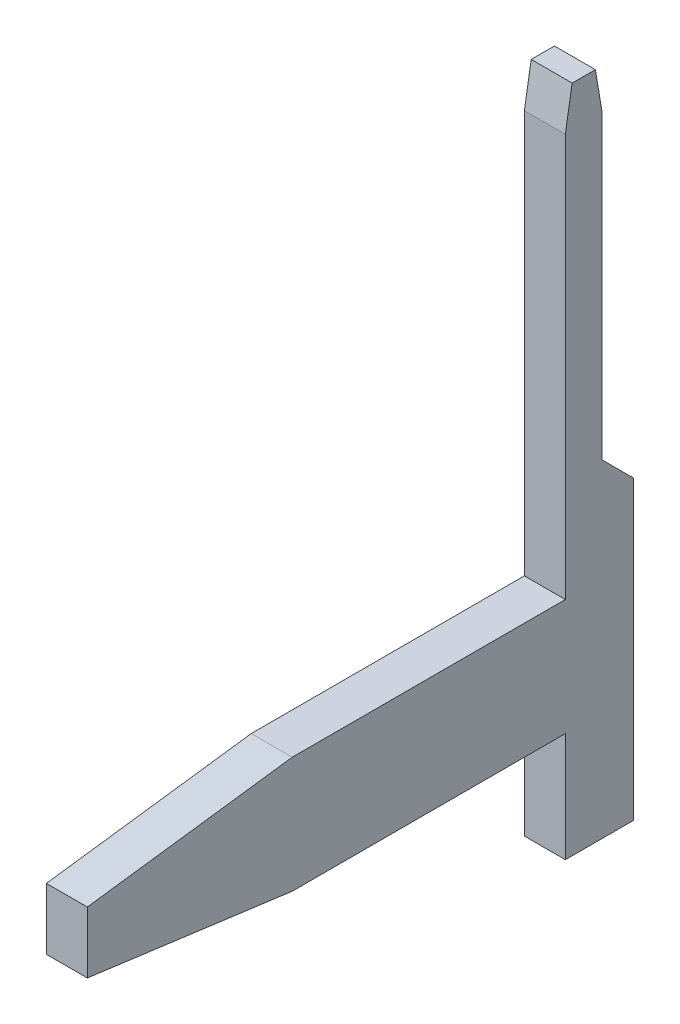
ISO-10303-21;
HEADER;
FILE_DESCRIPTION(('STEP AP214'),'2;1');
FILE_NAME('part.step','',(''),(''),'','','');
FILE_SCHEMA(('AUTOMOTIVE_DESIGN { 1 0 10303 214 1 1 1 1 }'));
ENDSEC;
DATA;
#1=APPLICATION_CONTEXT('core data for automotive mechanical design processes');
#2=APPLICATION_PROTOCOL_DEFINITION('international standard','automotive_design',2000,#1);
#3=PRODUCT_CONTEXT('',#1,'mechanical');
#4=PRODUCT('Part','Part','',(#3));
#5=PRODUCT_RELATED_PRODUCT_CATEGORY('part','',(#4));
#6=PRODUCT_DEFINITION_FORMATION('','',#4);
#7=PRODUCT_DEFINITION_CONTEXT('part definition',#1,'design');
#8=PRODUCT_DEFINITION('design','',#6,#7);
#9=PRODUCT_DEFINITION_SHAPE('','',#8);
#10=(LENGTH_UNIT() NAMED_UNIT(*) SI_UNIT(.MILLI.,.METRE.));
#11=(NAMED_UNIT(*) PLANE_ANGLE_UNIT() SI_UNIT($,.RADIAN.));
#12=(NAMED_UNIT(*) SI_UNIT($,.STERADIAN.) SOLID_ANGLE_UNIT());
#13=UNCERTAINTY_MEASURE_WITH_UNIT(LENGTH_MEASURE(1.E-05),#10,'distance_accuracy_value','');
#14=(GEOMETRIC_REPRESENTATION_CONTEXT(3) GLOBAL_UNCERTAINTY_ASSIGNED_CONTEXT((#13)) GLOBAL_UNIT_ASSIGNED_CONTEXT((#10,
#11,#12)) REPRESENTATION_CONTEXT('',''));
#15=CARTESIAN_POINT('',(0.,0.,0.));
#16=DIRECTION('',(0.,0.,1.));
#17=DIRECTION('',(1.,0.,0.));
#18=AXIS2_PLACEMENT_3D('',#15,#16,#17);
#19=CARTESIAN_POINT('',(-0.15,0.,0.));
#20=DIRECTION('',(1.,0.,0.));
#21=DIRECTION('',(0.,0.,-1.));
#22=AXIS2_PLACEMENT_3D('',#19,#20,#21);
#23=PLANE('',#22);
#24=DIRECTION('',(0.,0.986393923832198,-0.164398987305033));
#25=VECTOR('',#24,1.);
#26=CARTESIAN_POINT('',(-0.15,3.375,0.25));
#27=LINE('',#26,#25);
#28=CARTESIAN_POINT('',(-0.15,3.375,0.25));
#29=VERTEX_POINT('',#28);
#30=CARTESIAN_POINT('',(-0.15,3.675,0.200000000000025));
#31=VERTEX_POINT('',#30);
#32=EDGE_CURVE('E119',#29,#31,#27,.T.);
#33=ORIENTED_EDGE('',*,*,#32,.T.);
#34=DIRECTION('',(0.,0.,-1.));
#35=VECTOR('',#34,1.);
#36=CARTESIAN_POINT('',(-0.15,3.675,-0.02));
#37=LINE('',#36,#35);
#38=CARTESIAN_POINT('',(-0.15,3.675,0.03));
#39=VERTEX_POINT('',#38);
#40=EDGE_CURVE('E121',#31,#39,#37,.T.);
#41=ORIENTED_EDGE('',*,*,#40,.T.);
#42=DIRECTION('',(0.,0.986393923832144,0.164398987305357));
#43=VECTOR('',#42,1.);
#44=CARTESIAN_POINT('',(-0.15,3.375,-0.02));
#45=LINE('',#44,#43);
#46=CARTESIAN_POINT('',(-0.15,3.37499999999998,-0.0199999999999767));
#47=VERTEX_POINT('',#46);
#48=EDGE_CURVE('E20',#47,#39,#45,.T.);
#49=ORIENTED_EDGE('',*,*,#48,.F.);
#50=DIRECTION('',(0.,1.,0.));
#51=VECTOR('',#50,1.);
#52=CARTESIAN_POINT('',(-0.15,1.175,-0.02));
#53=LINE('',#52,#51);
#54=CARTESIAN_POINT('',(-0.15,1.175,-0.02));
#55=VERTEX_POINT('',#54);
#56=EDGE_CURVE('E185',#47,#55,#53,.F.);
#57=ORIENTED_EDGE('',*,*,#56,.T.);
#58=DIRECTION('',(0.,-0.707106781186548,-0.707106781186548));
#59=VECTOR('',#58,1.);
#60=CARTESIAN_POINT('',(-0.15,0.945,-0.25));
#61=LINE('',#60,#59);
#62=CARTESIAN_POINT('',(-0.15,0.945,-0.25));
#63=VERTEX_POINT('',#62);
#64=EDGE_CURVE('E180',#55,#63,#61,.T.);
#65=ORIENTED_EDGE('',*,*,#64,.T.);
#66=DIRECTION('',(0.,1.,0.));
#67=VECTOR('',#66,1.);
#68=CARTESIAN_POINT('',(-0.15,-1.225,-0.25));
#69=LINE('',#68,#67);
#70=CARTESIAN_POINT('',(-0.15,-1.225,-0.25));
#71=VERTEX_POINT('',#70);
#72=EDGE_CURVE('E175',#63,#71,#69,.F.);
#73=ORIENTED_EDGE('',*,*,#72,.T.);
#74=DIRECTION('',(0.,0.,1.));
#75=VECTOR('',#74,1.);
#76=CARTESIAN_POINT('',(-0.15,-1.225,0.25));
#77=LINE('',#76,#75);
#78=CARTESIAN_POINT('',(-0.15,-1.225,0.25));
#79=VERTEX_POINT('',#78);
#80=EDGE_CURVE('E170',#71,#79,#77,.T.);
#81=ORIENTED_EDGE('',*,*,#80,.T.);
#82=DIRECTION('',(0.,1.,0.));
#83=VECTOR('',#82,1.);
#84=CARTESIAN_POINT('',(-0.15,-0.425,0.25));
#85=LINE('',#84,#83);
#86=CARTESIAN_POINT('',(-0.15,-0.425,0.25));
#87=VERTEX_POINT('',#86);
#88=EDGE_CURVE('E165',#79,#87,#85,.T.);
#89=ORIENTED_EDGE('',*,*,#88,.T.);
#90=DIRECTION('',(0.,0.,1.));
#91=VECTOR('',#90,1.);
#92=CARTESIAN_POINT('',(-0.15,-0.425,3.75));
#93=LINE('',#92,#91);
#94=CARTESIAN_POINT('',(-0.15,-0.425,2.25));
#95=VERTEX_POINT('',#94);
#96=EDGE_CURVE('E159',#87,#95,#93,.T.);
#97=ORIENTED_EDGE('',*,*,#96,.T.);
#98=DIRECTION('',(0.,0.132163720090952,0.991227900682643));
#99=VECTOR('',#98,1.);
#100=CARTESIAN_POINT('',(-0.15,-0.425,2.25));
#101=LINE('',#100,#99);
#102=CARTESIAN_POINT('',(-0.15,-0.225000000000025,3.75));
#103=VERTEX_POINT('',#102);
#104=EDGE_CURVE('E155',#95,#103,#101,.T.);
#105=ORIENTED_EDGE('',*,*,#104,.T.);
#106=DIRECTION('',(0.,1.,0.));
#107=VECTOR('',#106,1.);
#108=CARTESIAN_POINT('',(-0.15,0.425,3.75));
#109=LINE('',#108,#107);
#110=CARTESIAN_POINT('',(-0.15,0.225,3.75));
#111=VERTEX_POINT('',#110);
#112=EDGE_CURVE('E152',#103,#111,#109,.T.);
#113=ORIENTED_EDGE('',*,*,#112,.T.);
#114=DIRECTION('',(0.,0.132163720090952,-0.991227900682643));
#115=VECTOR('',#114,1.);
#116=CARTESIAN_POINT('',(-0.15,0.225,3.75));
#117=LINE('',#116,#115);
#118=CARTESIAN_POINT('',(-0.15,0.424999999999975,2.25));
#119=VERTEX_POINT('',#118);
#120=EDGE_CURVE('E146',#111,#119,#117,.T.);
#121=ORIENTED_EDGE('',*,*,#120,.T.);
#122=DIRECTION('',(0.,0.,-1.));
#123=VECTOR('',#122,1.);
#124=CARTESIAN_POINT('',(-0.15,0.425,0.25));
#125=LINE('',#124,#123);
#126=CARTESIAN_POINT('',(-0.15,0.425,0.25));
#127=VERTEX_POINT('',#126);
#128=EDGE_CURVE('E144',#119,#127,#125,.T.);
#129=ORIENTED_EDGE('',*,*,#128,.T.);
#130=DIRECTION('',(0.,1.,0.));
#131=VECTOR('',#130,1.);
#132=CARTESIAN_POINT('',(-0.15,3.675,0.25));
#133=LINE('',#132,#131);
#134=EDGE_CURVE('E116',#127,#29,#133,.T.);
#135=ORIENTED_EDGE('',*,*,#134,.T.);
#136=EDGE_LOOP('',(#33,#41,#49,#57,#65,#73,#81,#89,#97,#105,#113,#121,#129,#135));
#137=FACE_BOUND('',#136,.T.);
#138=ADVANCED_FACE('F17',(#137),#23,.F.);
#139=CARTESIAN_POINT('',(0.15,3.675,-0.02));
#140=DIRECTION('',(0.,-1.,0.));
#141=DIRECTION('',(0.,0.,-1.));
#142=AXIS2_PLACEMENT_3D('',#139,#140,#141);
#143=PLANE('',#142);
#144=DIRECTION('',(1.,0.,0.));
#145=VECTOR('',#144,1.);
#146=CARTESIAN_POINT('',(0.15,3.67500000000002,0.200000000000099));
#147=LINE('',#146,#145);
#148=CARTESIAN_POINT('',(0.15,3.675,0.200000000000025));
#149=VERTEX_POINT('',#148);
#150=EDGE_CURVE('E126',#31,#149,#147,.T.);
#151=ORIENTED_EDGE('',*,*,#150,.T.);
#152=DIRECTION('',(0.,0.,-1.));
#153=VECTOR('',#152,1.);
#154=CARTESIAN_POINT('',(0.15,3.675,0.));
#155=LINE('',#154,#153);
#156=CARTESIAN_POINT('',(0.15,3.675,0.03));
#157=VERTEX_POINT('',#156);
#158=EDGE_CURVE('E190',#157,#149,#155,.F.);
#159=ORIENTED_EDGE('',*,*,#158,.F.);
#160=DIRECTION('',(1.,0.,0.));
#161=VECTOR('',#160,1.);
#162=CARTESIAN_POINT('',(0.15,3.675,0.03));
#163=LINE('',#162,#161);
#164=EDGE_CURVE('E132',#157,#39,#163,.F.);
#165=ORIENTED_EDGE('',*,*,#164,.T.);
#166=ORIENTED_EDGE('',*,*,#40,.F.);
#167=EDGE_LOOP('',(#151,#159,#165,#166));
#168=FACE_BOUND('',#167,.T.);
#169=ADVANCED_FACE('F129',(#168),#143,.F.);
#170=CARTESIAN_POINT('',(0.15,3.375,0.25));
#171=DIRECTION('',(0.,-0.164398987305033,-0.986393923832198));
#172=DIRECTION('',(0.,0.986393923832198,-0.164398987305033));
#173=AXIS2_PLACEMENT_3D('',#170,#171,#172);
#174=PLANE('',#173);
#175=ORIENTED_EDGE('',*,*,#150,.F.);
#176=ORIENTED_EDGE('',*,*,#32,.F.);
#177=DIRECTION('',(-1.,0.,0.));
#178=VECTOR('',#177,1.);
#179=CARTESIAN_POINT('',(0.15,3.375,0.25));
#180=LINE('',#179,#178);
#181=CARTESIAN_POINT('',(0.15,3.375,0.25));
#182=VERTEX_POINT('',#181);
#183=EDGE_CURVE('E138',#29,#182,#180,.F.);
#184=ORIENTED_EDGE('',*,*,#183,.T.);
#185=DIRECTION('',(0.,-0.986393923832144,0.164398987305357));
#186=VECTOR('',#185,1.);
#187=CARTESIAN_POINT('',(0.15,3.675,0.2));
#188=LINE('',#187,#186);
#189=EDGE_CURVE('E135',#149,#182,#188,.T.);
#190=ORIENTED_EDGE('',*,*,#189,.F.);
#191=EDGE_LOOP('',(#175,#176,#184,#190));
#192=FACE_BOUND('',#191,.T.);
#193=ADVANCED_FACE('F133',(#192),#174,.F.);
#194=CARTESIAN_POINT('',(0.15,3.675,0.25));
#195=DIRECTION('',(0.,0.,-1.));
#196=DIRECTION('',(-1.,0.,0.));
#197=AXIS2_PLACEMENT_3D('',#194,#195,#196);
#198=PLANE('',#197);
#199=ORIENTED_EDGE('',*,*,#183,.F.);
#200=ORIENTED_EDGE('',*,*,#134,.F.);
#201=DIRECTION('',(1.,0.,0.));
#202=VECTOR('',#201,1.);
#203=CARTESIAN_POINT('',(0.15,0.425,0.25));
#204=LINE('',#203,#202);
#205=CARTESIAN_POINT('',(0.15,0.425,0.25));
#206=VERTEX_POINT('',#205);
#207=EDGE_CURVE('E142',#127,#206,#204,.T.);
#208=ORIENTED_EDGE('',*,*,#207,.T.);
#209=DIRECTION('',(0.,1.,0.));
#210=VECTOR('',#209,1.);
#211=CARTESIAN_POINT('',(0.15,0.,0.25));
#212=LINE('',#211,#210);
#213=EDGE_CURVE('E193',#182,#206,#212,.F.);
#214=ORIENTED_EDGE('',*,*,#213,.F.);
#215=EDGE_LOOP('',(#199,#200,#208,#214));
#216=FACE_BOUND('',#215,.T.);
#217=ADVANCED_FACE('F277',(#216),#198,.F.);
#218=CARTESIAN_POINT('',(0.15,0.425,0.25));
#219=DIRECTION('',(0.,-1.,0.));
#220=DIRECTION('',(0.,0.,-1.));
#221=AXIS2_PLACEMENT_3D('',#218,#219,#220);
#222=PLANE('',#221);
#223=DIRECTION('',(1.,0.,0.));
#224=VECTOR('',#223,1.);
#225=CARTESIAN_POINT('',(0.15,0.424999999999901,2.24999999999999));
#226=LINE('',#225,#224);
#227=CARTESIAN_POINT('',(0.15,0.424999999999975,2.25));
#228=VERTEX_POINT('',#227);
#229=EDGE_CURVE('E148',#119,#228,#226,.T.);
#230=ORIENTED_EDGE('',*,*,#229,.T.);
#231=DIRECTION('',(0.,0.,-1.));
#232=VECTOR('',#231,1.);
#233=CARTESIAN_POINT('',(0.15,0.425,0.));
#234=LINE('',#233,#232);
#235=EDGE_CURVE('E196',#206,#228,#234,.F.);
#236=ORIENTED_EDGE('',*,*,#235,.F.);
#237=ORIENTED_EDGE('',*,*,#207,.F.);
#238=ORIENTED_EDGE('',*,*,#128,.F.);
#239=EDGE_LOOP('',(#230,#236,#237,#238));
#240=FACE_BOUND('',#239,.T.);
#241=ADVANCED_FACE('F273',(#240),#222,.F.);
#242=CARTESIAN_POINT('',(0.15,0.225,3.75));
#243=DIRECTION('',(0.,-0.991227900682643,-0.132163720090952));
#244=DIRECTION('',(0.,0.132163720090952,-0.991227900682643));
#245=AXIS2_PLACEMENT_3D('',#242,#243,#244);
#246=PLANE('',#245);
#247=ORIENTED_EDGE('',*,*,#229,.F.);
#248=ORIENTED_EDGE('',*,*,#120,.F.);
#249=DIRECTION('',(-1.,0.,0.));
#250=VECTOR('',#249,1.);
#251=CARTESIAN_POINT('',(0.15,0.225,3.75));
#252=LINE('',#251,#250);
#253=CARTESIAN_POINT('',(0.15,0.225,3.75));
#254=VERTEX_POINT('',#253);
#255=EDGE_CURVE('E150',#111,#254,#252,.F.);
#256=ORIENTED_EDGE('',*,*,#255,.T.);
#257=DIRECTION('',(0.,-0.132163720091018,0.991227900682635));
#258=VECTOR('',#257,1.);
#259=CARTESIAN_POINT('',(0.15,0.425,2.25));
#260=LINE('',#259,#258);
#261=EDGE_CURVE('E199',#228,#254,#260,.T.);
#262=ORIENTED_EDGE('',*,*,#261,.F.);
#263=EDGE_LOOP('',(#247,#248,#256,#262));
#264=FACE_BOUND('',#263,.T.);
#265=ADVANCED_FACE('F269',(#264),#246,.F.);
#266=CARTESIAN_POINT('',(0.15,0.425,3.75));
#267=DIRECTION('',(0.,0.,-1.));
#268=DIRECTION('',(-1.,0.,0.));
#269=AXIS2_PLACEMENT_3D('',#266,#267,#268);
#270=PLANE('',#269);
#271=DIRECTION('',(1.,0.,0.));
#272=VECTOR('',#271,1.);
#273=CARTESIAN_POINT('',(0.15,-0.225000000000099,3.75000000000001));
#274=LINE('',#273,#272);
#275=CARTESIAN_POINT('',(0.15,-0.225000000000025,3.75));
#276=VERTEX_POINT('',#275);
#277=EDGE_CURVE('E157',#103,#276,#274,.T.);
#278=ORIENTED_EDGE('',*,*,#277,.T.);
#279=DIRECTION('',(0.,1.,0.));
#280=VECTOR('',#279,1.);
#281=CARTESIAN_POINT('',(0.15,0.,3.75));
#282=LINE('',#281,#280);
#283=EDGE_CURVE('E202',#254,#276,#282,.F.);
#284=ORIENTED_EDGE('',*,*,#283,.F.);
#285=ORIENTED_EDGE('',*,*,#255,.F.);
#286=ORIENTED_EDGE('',*,*,#112,.F.);
#287=EDGE_LOOP('',(#278,#284,#285,#286));
#288=FACE_BOUND('',#287,.T.);
#289=ADVANCED_FACE('F265',(#288),#270,.F.);
#290=CARTESIAN_POINT('',(0.15,-0.425,2.25));
#291=DIRECTION('',(0.,0.991227900682643,-0.132163720090952));
#292=DIRECTION('',(0.,0.132163720090952,0.991227900682643));
#293=AXIS2_PLACEMENT_3D('',#290,#291,#292);
#294=PLANE('',#293);
#295=ORIENTED_EDGE('',*,*,#277,.F.);
#296=ORIENTED_EDGE('',*,*,#104,.F.);
#297=DIRECTION('',(1.,0.,0.));
#298=VECTOR('',#297,1.);
#299=CARTESIAN_POINT('',(0.15,-0.425,2.25));
#300=LINE('',#299,#298);
#301=CARTESIAN_POINT('',(0.15,-0.425,2.25));
#302=VERTEX_POINT('',#301);
#303=EDGE_CURVE('E161',#95,#302,#300,.T.);
#304=ORIENTED_EDGE('',*,*,#303,.T.);
#305=DIRECTION('',(0.,-0.132163720091018,-0.991227900682635));
#306=VECTOR('',#305,1.);
#307=CARTESIAN_POINT('',(0.15,-0.225,3.75));
#308=LINE('',#307,#306);
#309=EDGE_CURVE('E205',#276,#302,#308,.T.);
#310=ORIENTED_EDGE('',*,*,#309,.F.);
#311=EDGE_LOOP('',(#295,#296,#304,#310));
#312=FACE_BOUND('',#311,.T.);
#313=ADVANCED_FACE('F261',(#312),#294,.F.);
#314=CARTESIAN_POINT('',(0.15,-0.425,3.75));
#315=DIRECTION('',(0.,1.,0.));
#316=DIRECTION('',(0.,0.,1.));
#317=AXIS2_PLACEMENT_3D('',#314,#315,#316);
#318=PLANE('',#317);
#319=ORIENTED_EDGE('',*,*,#303,.F.);
#320=ORIENTED_EDGE('',*,*,#96,.F.);
#321=DIRECTION('',(-1.,0.,0.));
#322=VECTOR('',#321,1.);
#323=CARTESIAN_POINT('',(0.15,-0.425,0.25));
#324=LINE('',#323,#322);
#325=CARTESIAN_POINT('',(0.15,-0.425,0.25));
#326=VERTEX_POINT('',#325);
#327=EDGE_CURVE('E163',#87,#326,#324,.F.);
#328=ORIENTED_EDGE('',*,*,#327,.T.);
#329=DIRECTION('',(0.,0.,-1.));
#330=VECTOR('',#329,1.);
#331=CARTESIAN_POINT('',(0.15,-0.425,0.));
#332=LINE('',#331,#330);
#333=EDGE_CURVE('E208',#302,#326,#332,.T.);
#334=ORIENTED_EDGE('',*,*,#333,.F.);
#335=EDGE_LOOP('',(#319,#320,#328,#334));
#336=FACE_BOUND('',#335,.T.);
#337=ADVANCED_FACE('F257',(#336),#318,.F.);
#338=CARTESIAN_POINT('',(0.15,-0.425,0.25));
#339=DIRECTION('',(0.,0.,-1.));
#340=DIRECTION('',(-1.,0.,0.));
#341=AXIS2_PLACEMENT_3D('',#338,#339,#340);
#342=PLANE('',#341);
#343=DIRECTION('',(1.,0.,0.));
#344=VECTOR('',#343,1.);
#345=CARTESIAN_POINT('',(0.15,-1.225,0.25));
#346=LINE('',#345,#344);
#347=CARTESIAN_POINT('',(0.15,-1.225,0.25));
#348=VERTEX_POINT('',#347);
#349=EDGE_CURVE('E168',#79,#348,#346,.T.);
#350=ORIENTED_EDGE('',*,*,#349,.T.);
#351=DIRECTION('',(0.,1.,0.));
#352=VECTOR('',#351,1.);
#353=CARTESIAN_POINT('',(0.15,0.,0.25));
#354=LINE('',#353,#352);
#355=EDGE_CURVE('E211',#326,#348,#354,.F.);
#356=ORIENTED_EDGE('',*,*,#355,.F.);
#357=ORIENTED_EDGE('',*,*,#327,.F.);
#358=ORIENTED_EDGE('',*,*,#88,.F.);
#359=EDGE_LOOP('',(#350,#356,#357,#358));
#360=FACE_BOUND('',#359,.T.);
#361=ADVANCED_FACE('F253',(#360),#342,.F.);
#362=CARTESIAN_POINT('',(0.15,-1.225,0.25));
#363=DIRECTION('',(0.,1.,0.));
#364=DIRECTION('',(0.,0.,1.));
#365=AXIS2_PLACEMENT_3D('',#362,#363,#364);
#366=PLANE('',#365);
#367=DIRECTION('',(1.,0.,0.));
#368=VECTOR('',#367,1.);
#369=CARTESIAN_POINT('',(0.15,-1.225,-0.25));
#370=LINE('',#369,#368);
#371=CARTESIAN_POINT('',(0.15,-1.225,-0.25));
#372=VERTEX_POINT('',#371);
#373=EDGE_CURVE('E173',#71,#372,#370,.T.);
#374=ORIENTED_EDGE('',*,*,#373,.T.);
#375=DIRECTION('',(0.,0.,-1.));
#376=VECTOR('',#375,1.);
#377=CARTESIAN_POINT('',(0.15,-1.225,0.));
#378=LINE('',#377,#376);
#379=EDGE_CURVE('E214',#348,#372,#378,.T.);
#380=ORIENTED_EDGE('',*,*,#379,.F.);
#381=ORIENTED_EDGE('',*,*,#349,.F.);
#382=ORIENTED_EDGE('',*,*,#80,.F.);
#383=EDGE_LOOP('',(#374,#380,#381,#382));
#384=FACE_BOUND('',#383,.T.);
#385=ADVANCED_FACE('F249',(#384),#366,.F.);
#386=CARTESIAN_POINT('',(0.15,-1.225,-0.25));
#387=DIRECTION('',(0.,0.,1.));
#388=DIRECTION('',(1.,0.,0.));
#389=AXIS2_PLACEMENT_3D('',#386,#387,#388);
#390=PLANE('',#389);
#391=DIRECTION('',(1.,0.,0.));
#392=VECTOR('',#391,1.);
#393=CARTESIAN_POINT('',(0.15,0.945,-0.25));
#394=LINE('',#393,#392);
#395=CARTESIAN_POINT('',(0.15,0.945,-0.25));
#396=VERTEX_POINT('',#395);
#397=EDGE_CURVE('E178',#63,#396,#394,.T.);
#398=ORIENTED_EDGE('',*,*,#397,.T.);
#399=DIRECTION('',(0.,1.,0.));
#400=VECTOR('',#399,1.);
#401=CARTESIAN_POINT('',(0.15,0.,-0.25));
#402=LINE('',#401,#400);
#403=EDGE_CURVE('E217',#372,#396,#402,.T.);
#404=ORIENTED_EDGE('',*,*,#403,.F.);
#405=ORIENTED_EDGE('',*,*,#373,.F.);
#406=ORIENTED_EDGE('',*,*,#72,.F.);
#407=EDGE_LOOP('',(#398,#404,#405,#406));
#408=FACE_BOUND('',#407,.T.);
#409=ADVANCED_FACE('F246',(#408),#390,.F.);
#410=CARTESIAN_POINT('',(0.15,0.945,-0.25));
#411=DIRECTION('',(0.,-0.707106781186548,0.707106781186548));
#412=DIRECTION('',(0.,-0.707106781186548,-0.707106781186548));
#413=AXIS2_PLACEMENT_3D('',#410,#411,#412);
#414=PLANE('',#413);
#415=DIRECTION('',(1.,0.,0.));
#416=VECTOR('',#415,1.);
#417=CARTESIAN_POINT('',(0.15,1.175,-0.02));
#418=LINE('',#417,#416);
#419=CARTESIAN_POINT('',(0.15,1.175,-0.02));
#420=VERTEX_POINT('',#419);
#421=EDGE_CURVE('E183',#55,#420,#418,.T.);
#422=ORIENTED_EDGE('',*,*,#421,.T.);
#423=DIRECTION('',(0.,0.707106781186548,0.707106781186547));
#424=VECTOR('',#423,1.);
#425=CARTESIAN_POINT('',(0.15,0.945,-0.25));
#426=LINE('',#425,#424);
#427=EDGE_CURVE('E220',#396,#420,#426,.T.);
#428=ORIENTED_EDGE('',*,*,#427,.F.);
#429=ORIENTED_EDGE('',*,*,#397,.F.);
#430=ORIENTED_EDGE('',*,*,#64,.F.);
#431=EDGE_LOOP('',(#422,#428,#429,#430));
#432=FACE_BOUND('',#431,.T.);
#433=ADVANCED_FACE('F230',(#432),#414,.F.);
#434=CARTESIAN_POINT('',(0.15,1.175,-0.02));
#435=DIRECTION('',(0.,0.,1.));
#436=DIRECTION('',(1.,0.,0.));
#437=AXIS2_PLACEMENT_3D('',#434,#435,#436);
#438=PLANE('',#437);
#439=DIRECTION('',(1.,0.,0.));
#440=VECTOR('',#439,1.);
#441=CARTESIAN_POINT('',(0.15,3.37499999999998,-0.0199999999999014));
#442=LINE('',#441,#440);
#443=CARTESIAN_POINT('',(0.15,3.37499999999999,-0.019999999999976));
#444=VERTEX_POINT('',#443);
#445=EDGE_CURVE('E35',#47,#444,#442,.T.);
#446=ORIENTED_EDGE('',*,*,#445,.T.);
#447=DIRECTION('',(0.,1.,0.));
#448=VECTOR('',#447,1.);
#449=CARTESIAN_POINT('',(0.15,0.,-0.02));
#450=LINE('',#449,#448);
#451=EDGE_CURVE('E26',#420,#444,#450,.T.);
#452=ORIENTED_EDGE('',*,*,#451,.F.);
#453=ORIENTED_EDGE('',*,*,#421,.F.);
#454=ORIENTED_EDGE('',*,*,#56,.F.);
#455=EDGE_LOOP('',(#446,#452,#453,#454));
#456=FACE_BOUND('',#455,.T.);
#457=ADVANCED_FACE('F228',(#456),#438,.F.);
#458=CARTESIAN_POINT('',(0.15,3.675,0.03));
#459=DIRECTION('',(0.,-0.164398987305033,0.986393923832198));
#460=DIRECTION('',(0.,-0.986393923832198,-0.164398987305033));
#461=AXIS2_PLACEMENT_3D('',#458,#459,#460);
#462=PLANE('',#461);
#463=ORIENTED_EDGE('',*,*,#445,.F.);
#464=ORIENTED_EDGE('',*,*,#48,.T.);
#465=ORIENTED_EDGE('',*,*,#164,.F.);
#466=DIRECTION('',(0.,0.986393923832144,0.164398987305357));
#467=VECTOR('',#466,1.);
#468=CARTESIAN_POINT('',(0.15,3.375,-0.02));
#469=LINE('',#468,#467);
#470=EDGE_CURVE('E11',#444,#157,#469,.T.);
#471=ORIENTED_EDGE('',*,*,#470,.F.);
#472=EDGE_LOOP('',(#463,#464,#465,#471));
#473=FACE_BOUND('',#472,.T.);
#474=ADVANCED_FACE('F233',(#473),#462,.F.);
#475=CARTESIAN_POINT('',(0.15,0.,0.));
#476=DIRECTION('',(1.,0.,0.));
#477=DIRECTION('',(0.,0.,-1.));
#478=AXIS2_PLACEMENT_3D('',#475,#476,#477);
#479=PLANE('',#478);
#480=ORIENTED_EDGE('',*,*,#451,.T.);
#481=ORIENTED_EDGE('',*,*,#470,.T.);
#482=ORIENTED_EDGE('',*,*,#158,.T.);
#483=ORIENTED_EDGE('',*,*,#189,.T.);
#484=ORIENTED_EDGE('',*,*,#213,.T.);
#485=ORIENTED_EDGE('',*,*,#235,.T.);
#486=ORIENTED_EDGE('',*,*,#261,.T.);
#487=ORIENTED_EDGE('',*,*,#283,.T.);
#488=ORIENTED_EDGE('',*,*,#309,.T.);
#489=ORIENTED_EDGE('',*,*,#333,.T.);
#490=ORIENTED_EDGE('',*,*,#355,.T.);
#491=ORIENTED_EDGE('',*,*,#379,.T.);
#492=ORIENTED_EDGE('',*,*,#403,.T.);
#493=ORIENTED_EDGE('',*,*,#427,.T.);
#494=EDGE_LOOP('',(#480,#481,#482,#483,#484,#485,#486,#487,#488,#489,#490,#491,#492,#493));
#495=FACE_BOUND('',#494,.T.);
#496=ADVANCED_FACE('F225',(#495),#479,.T.);
#497=CLOSED_SHELL('',(#138,#169,#193,#217,#241,#265,#289,#313,#337,#361,#385,#409,#433,#457,
#474,#496));
#498=MANIFOLD_SOLID_BREP('B1',#497);
#499=ADVANCED_BREP_SHAPE_REPRESENTATION('',(#18,#498),#14);
#500=SHAPE_DEFINITION_REPRESENTATION(#9,#499);
ENDSEC;
END-ISO-10303-21;
